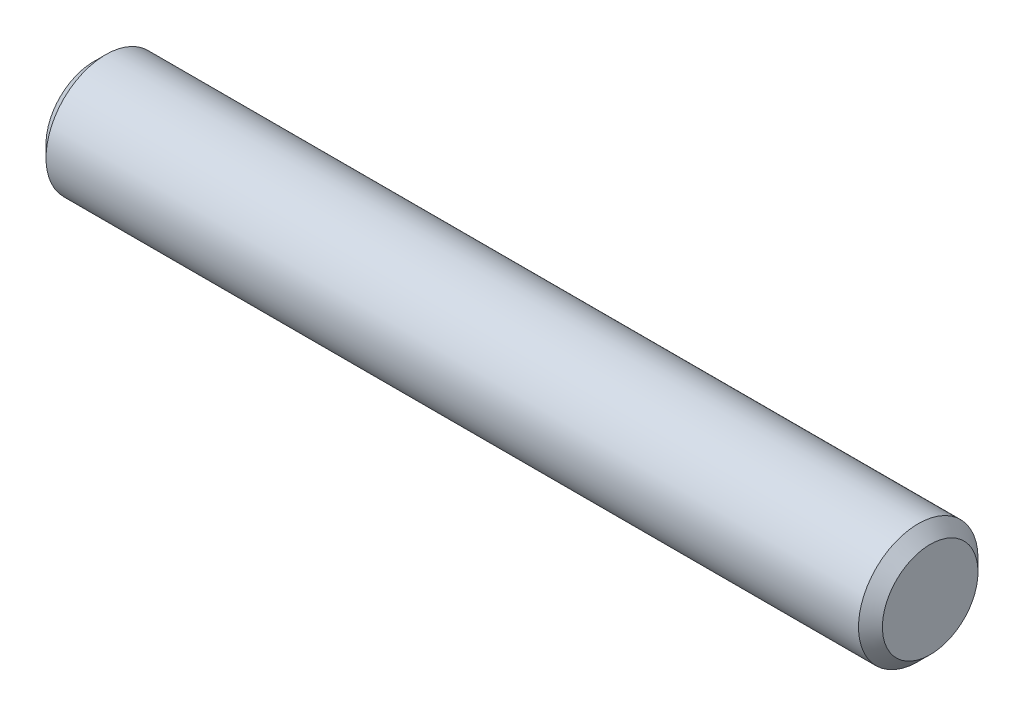
ISO-10303-21;
HEADER;
FILE_DESCRIPTION(('STEP AP214'),'2;1');
FILE_NAME('part.step','',(''),(''),'','','');
FILE_SCHEMA(('AUTOMOTIVE_DESIGN { 1 0 10303 214 1 1 1 1 }'));
ENDSEC;
DATA;
#1=APPLICATION_CONTEXT('core data for automotive mechanical design processes');
#2=APPLICATION_PROTOCOL_DEFINITION('international standard','automotive_design',2000,#1);
#3=PRODUCT_CONTEXT('',#1,'mechanical');
#4=PRODUCT('Part','Part','',(#3));
#5=PRODUCT_RELATED_PRODUCT_CATEGORY('part','',(#4));
#6=PRODUCT_DEFINITION_FORMATION('','',#4);
#7=PRODUCT_DEFINITION_CONTEXT('part definition',#1,'design');
#8=PRODUCT_DEFINITION('design','',#6,#7);
#9=PRODUCT_DEFINITION_SHAPE('','',#8);
#10=(LENGTH_UNIT() NAMED_UNIT(*) SI_UNIT(.MILLI.,.METRE.));
#11=(NAMED_UNIT(*) PLANE_ANGLE_UNIT() SI_UNIT($,.RADIAN.));
#12=(NAMED_UNIT(*) SI_UNIT($,.STERADIAN.) SOLID_ANGLE_UNIT());
#13=UNCERTAINTY_MEASURE_WITH_UNIT(LENGTH_MEASURE(1.E-05),#10,'distance_accuracy_value','');
#14=(GEOMETRIC_REPRESENTATION_CONTEXT(3) GLOBAL_UNCERTAINTY_ASSIGNED_CONTEXT((#13)) GLOBAL_UNIT_ASSIGNED_CONTEXT((#10,
#11,#12)) REPRESENTATION_CONTEXT('',''));
#15=CARTESIAN_POINT('',(0.,0.,0.));
#16=DIRECTION('',(0.,0.,1.));
#17=DIRECTION('',(1.,0.,0.));
#18=AXIS2_PLACEMENT_3D('',#15,#16,#17);
#19=CARTESIAN_POINT('',(-22.225,0.,0.));
#20=DIRECTION('',(1.,0.,0.));
#21=DIRECTION('',(0.,0.,-1.));
#22=AXIS2_PLACEMENT_3D('',#19,#20,#21);
#23=CYLINDRICAL_SURFACE('',#22,3.175);
#24=CARTESIAN_POINT('',(21.59,0.,0.));
#25=DIRECTION('',(1.,0.,0.));
#26=DIRECTION('',(0.,0.,-1.));
#27=AXIS2_PLACEMENT_3D('',#24,#25,#26);
#28=CIRCLE('',#27,3.175);
#29=CARTESIAN_POINT('',(21.59,0.,-3.175));
#30=VERTEX_POINT('',#29);
#31=EDGE_CURVE('E37',#30,#30,#28,.F.);
#32=ORIENTED_EDGE('',*,*,#31,.T.);
#33=EDGE_LOOP('',(#32));
#34=FACE_BOUND('',#33,.T.);
#35=CARTESIAN_POINT('',(-21.59,0.,0.));
#36=DIRECTION('',(1.,0.,0.));
#37=DIRECTION('',(0.,0.,-1.));
#38=AXIS2_PLACEMENT_3D('',#35,#36,#37);
#39=CIRCLE('',#38,3.175);
#40=CARTESIAN_POINT('',(-21.59,0.,-3.175));
#41=VERTEX_POINT('',#40);
#42=EDGE_CURVE('E41',#41,#41,#39,.T.);
#43=ORIENTED_EDGE('',*,*,#42,.T.);
#44=EDGE_LOOP('',(#43));
#45=FACE_BOUND('',#44,.T.);
#46=ADVANCED_FACE('F30',(#34,#45),#23,.T.);
#47=CARTESIAN_POINT('',(-22.225,0.,0.));
#48=DIRECTION('',(1.,0.,0.));
#49=DIRECTION('',(0.,0.,-1.));
#50=AXIS2_PLACEMENT_3D('',#47,#48,#49);
#51=PLANE('',#50);
#52=CARTESIAN_POINT('',(-22.225,0.,0.));
#53=DIRECTION('',(1.,0.,0.));
#54=DIRECTION('',(0.,0.,-1.));
#55=AXIS2_PLACEMENT_3D('',#52,#53,#54);
#56=CIRCLE('',#55,2.54);
#57=CARTESIAN_POINT('',(-22.225,0.,-2.54));
#58=VERTEX_POINT('',#57);
#59=EDGE_CURVE('E10',#58,#58,#56,.F.);
#60=ORIENTED_EDGE('',*,*,#59,.T.);
#61=EDGE_LOOP('',(#60));
#62=FACE_BOUND('',#61,.T.);
#63=ADVANCED_FACE('F61',(#62),#51,.F.);
#64=CARTESIAN_POINT('',(22.225,0.,0.));
#65=DIRECTION('',(1.,0.,0.));
#66=DIRECTION('',(0.,0.,-1.));
#67=AXIS2_PLACEMENT_3D('',#64,#65,#66);
#68=PLANE('',#67);
#69=CARTESIAN_POINT('',(22.225,0.,0.));
#70=DIRECTION('',(1.,0.,0.));
#71=DIRECTION('',(0.,0.,-1.));
#72=AXIS2_PLACEMENT_3D('',#69,#70,#71);
#73=CIRCLE('',#72,2.54000000000001);
#74=CARTESIAN_POINT('',(22.225,0.,-2.54000000000001));
#75=VERTEX_POINT('',#74);
#76=EDGE_CURVE('E45',#75,#75,#73,.T.);
#77=ORIENTED_EDGE('',*,*,#76,.T.);
#78=EDGE_LOOP('',(#77));
#79=FACE_BOUND('',#78,.T.);
#80=ADVANCED_FACE('F51',(#79),#68,.T.);
#81=CARTESIAN_POINT('',(22.225,0.,0.));
#82=DIRECTION('',(-1.,0.,0.));
#83=DIRECTION('',(0.,0.,1.));
#84=AXIS2_PLACEMENT_3D('',#81,#82,#83);
#85=CONICAL_SURFACE('',#84,2.54000000000001,0.785398163397445);
#86=ORIENTED_EDGE('',*,*,#31,.F.);
#87=EDGE_LOOP('',(#86));
#88=FACE_BOUND('',#87,.T.);
#89=ORIENTED_EDGE('',*,*,#76,.F.);
#90=EDGE_LOOP('',(#89));
#91=FACE_BOUND('',#90,.T.);
#92=ADVANCED_FACE('F53',(#88,#91),#85,.T.);
#93=CARTESIAN_POINT('',(-21.59,0.,0.));
#94=DIRECTION('',(1.,0.,0.));
#95=DIRECTION('',(0.,0.,-1.));
#96=AXIS2_PLACEMENT_3D('',#93,#94,#95);
#97=CONICAL_SURFACE('',#96,3.175,0.78539816339745);
#98=ORIENTED_EDGE('',*,*,#59,.F.);
#99=EDGE_LOOP('',(#98));
#100=FACE_BOUND('',#99,.T.);
#101=ORIENTED_EDGE('',*,*,#42,.F.);
#102=EDGE_LOOP('',(#101));
#103=FACE_BOUND('',#102,.T.);
#104=ADVANCED_FACE('F32',(#100,#103),#97,.T.);
#105=CLOSED_SHELL('',(#46,#63,#80,#92,#104));
#106=MANIFOLD_SOLID_BREP('B2',#105);
#107=ADVANCED_BREP_SHAPE_REPRESENTATION('',(#18,#106),#14);
#108=SHAPE_DEFINITION_REPRESENTATION(#9,#107);
ENDSEC;
END-ISO-10303-21;
